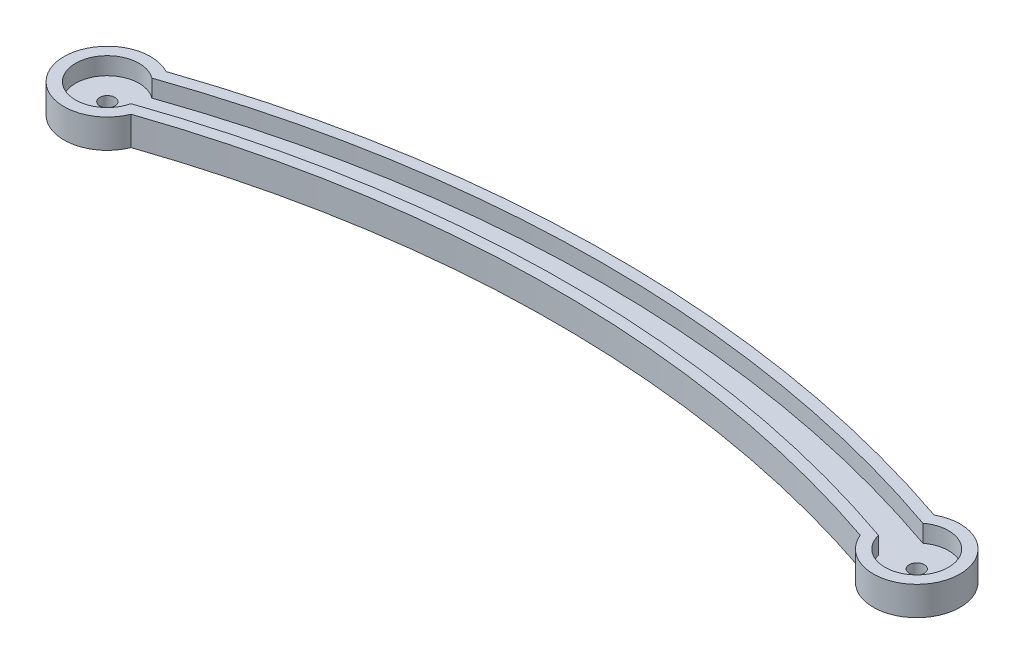
ISO-10303-21;
HEADER;
FILE_DESCRIPTION(('STEP AP214'),'2;1');
FILE_NAME('part.step','',(''),(''),'','','');
FILE_SCHEMA(('AUTOMOTIVE_DESIGN { 1 0 10303 214 1 1 1 1 }'));
ENDSEC;
DATA;
#1=APPLICATION_CONTEXT('core data for automotive mechanical design processes');
#2=APPLICATION_PROTOCOL_DEFINITION('international standard','automotive_design',2000,#1);
#3=PRODUCT_CONTEXT('',#1,'mechanical');
#4=PRODUCT('Part','Part','',(#3));
#5=PRODUCT_RELATED_PRODUCT_CATEGORY('part','',(#4));
#6=PRODUCT_DEFINITION_FORMATION('','',#4);
#7=PRODUCT_DEFINITION_CONTEXT('part definition',#1,'design');
#8=PRODUCT_DEFINITION('design','',#6,#7);
#9=PRODUCT_DEFINITION_SHAPE('','',#8);
#10=(LENGTH_UNIT() NAMED_UNIT(*) SI_UNIT(.MILLI.,.METRE.));
#11=(NAMED_UNIT(*) PLANE_ANGLE_UNIT() SI_UNIT($,.RADIAN.));
#12=(NAMED_UNIT(*) SI_UNIT($,.STERADIAN.) SOLID_ANGLE_UNIT());
#13=UNCERTAINTY_MEASURE_WITH_UNIT(LENGTH_MEASURE(1.E-05),#10,'distance_accuracy_value','');
#14=(GEOMETRIC_REPRESENTATION_CONTEXT(3) GLOBAL_UNCERTAINTY_ASSIGNED_CONTEXT((#13)) GLOBAL_UNIT_ASSIGNED_CONTEXT((#10,
#11,#12)) REPRESENTATION_CONTEXT('',''));
#15=CARTESIAN_POINT('',(0.,0.,0.));
#16=DIRECTION('',(0.,0.,1.));
#17=DIRECTION('',(1.,0.,0.));
#18=AXIS2_PLACEMENT_3D('',#15,#16,#17);
#19=CARTESIAN_POINT('',(105.,2.,93.674969975976));
#20=DIRECTION('',(0.,-1.,0.));
#21=DIRECTION('',(0.,0.,-1.));
#22=AXIS2_PLACEMENT_3D('',#19,#20,#21);
#23=PLANE('',#22);
#24=CARTESIAN_POINT('',(140.,2.,0.));
#25=DIRECTION('',(0.,1.,0.));
#26=DIRECTION('',(0.,0.,1.));
#27=AXIS2_PLACEMENT_3D('',#24,#25,#26);
#28=CIRCLE('',#27,1.3);
#29=CARTESIAN_POINT('',(140.,2.,1.3));
#30=VERTEX_POINT('',#29);
#31=EDGE_CURVE('E247',#30,#30,#28,.T.);
#32=ORIENTED_EDGE('',*,*,#31,.F.);
#33=EDGE_LOOP('',(#32));
#34=FACE_BOUND('',#33,.T.);
#35=CARTESIAN_POINT('',(70.,2.,187.349939951952));
#36=DIRECTION('',(0.,-1.,0.));
#37=DIRECTION('',(0.,0.,-1.));
#38=AXIS2_PLACEMENT_3D('',#35,#36,#37);
#39=CIRCLE('',#38,197.);
#40=CARTESIAN_POINT('',(5.35399867099803,2.,1.25884797769686));
#41=VERTEX_POINT('',#40);
#42=CARTESIAN_POINT('',(134.646001329002,2.,1.25884797769687));
#43=VERTEX_POINT('',#42);
#44=EDGE_CURVE('E119',#41,#43,#39,.T.);
#45=ORIENTED_EDGE('',*,*,#44,.T.);
#46=CARTESIAN_POINT('',(140.,2.,0.));
#47=DIRECTION('',(0.,-1.,0.));
#48=DIRECTION('',(0.,0.,-1.));
#49=AXIS2_PLACEMENT_3D('',#46,#47,#48);
#50=CIRCLE('',#49,5.50000000000002);
#51=CARTESIAN_POINT('',(136.681222163445,2.,-4.38585381329485));
#52=VERTEX_POINT('',#51);
#53=EDGE_CURVE('E113',#43,#52,#50,.F.);
#54=ORIENTED_EDGE('',*,*,#53,.T.);
#55=CARTESIAN_POINT('',(70.,2.,187.349939951952));
#56=DIRECTION('',(0.,-1.,0.));
#57=DIRECTION('',(0.,0.,-1.));
#58=AXIS2_PLACEMENT_3D('',#55,#56,#57);
#59=CIRCLE('',#58,203.);
#60=CARTESIAN_POINT('',(3.31877783655477,2.,-4.38585381329485));
#61=VERTEX_POINT('',#60);
#62=EDGE_CURVE('E117',#52,#61,#59,.F.);
#63=ORIENTED_EDGE('',*,*,#62,.T.);
#64=CARTESIAN_POINT('',(0.,2.,0.));
#65=DIRECTION('',(0.,-1.,0.));
#66=DIRECTION('',(0.,0.,-1.));
#67=AXIS2_PLACEMENT_3D('',#64,#65,#66);
#68=CIRCLE('',#67,5.50000000000001);
#69=EDGE_CURVE('E134',#61,#41,#68,.F.);
#70=ORIENTED_EDGE('',*,*,#69,.T.);
#71=EDGE_LOOP('',(#45,#54,#63,#70));
#72=FACE_BOUND('',#71,.T.);
#73=CARTESIAN_POINT('',(0.,2.,0.));
#74=DIRECTION('',(0.,1.,0.));
#75=DIRECTION('',(0.,0.,1.));
#76=AXIS2_PLACEMENT_3D('',#73,#74,#75);
#77=CIRCLE('',#76,1.29999999999999);
#78=CARTESIAN_POINT('',(0.,2.,1.29999999999999));
#79=VERTEX_POINT('',#78);
#80=EDGE_CURVE('E215',#79,#79,#77,.T.);
#81=ORIENTED_EDGE('',*,*,#80,.F.);
#82=EDGE_LOOP('',(#81));
#83=FACE_BOUND('',#82,.T.);
#84=ADVANCED_FACE('F39',(#34,#72,#83),#23,.F.);
#85=CARTESIAN_POINT('',(70.,5.,187.349939951952));
#86=DIRECTION('',(0.,-1.,0.));
#87=DIRECTION('',(0.,0.,-1.));
#88=AXIS2_PLACEMENT_3D('',#85,#86,#87);
#89=CYLINDRICAL_SURFACE('',#88,195.);
#90=CARTESIAN_POINT('',(70.,0.,187.349939951952));
#91=DIRECTION('',(0.,-1.,0.));
#92=DIRECTION('',(0.,0.,-1.));
#93=AXIS2_PLACEMENT_3D('',#90,#91,#92);
#94=CIRCLE('',#93,195.);
#95=CARTESIAN_POINT('',(6.947544161013,0.,2.825177893651));
#96=VERTEX_POINT('',#95);
#97=CARTESIAN_POINT('',(133.052455838987,0.,2.825177893651));
#98=VERTEX_POINT('',#97);
#99=EDGE_CURVE('E154',#96,#98,#94,.T.);
#100=ORIENTED_EDGE('',*,*,#99,.T.);
#101=DIRECTION('',(0.,-1.,0.));
#102=VECTOR('',#101,1.);
#103=CARTESIAN_POINT('',(133.052455838987,5.,2.825177893651));
#104=LINE('',#103,#102);
#105=CARTESIAN_POINT('',(133.052455838987,5.,2.825177893651));
#106=VERTEX_POINT('',#105);
#107=EDGE_CURVE('E11',#106,#98,#104,.T.);
#108=ORIENTED_EDGE('',*,*,#107,.F.);
#109=CARTESIAN_POINT('',(70.,5.,187.349939951952));
#110=DIRECTION('',(0.,-1.,0.));
#111=DIRECTION('',(0.,0.,-1.));
#112=AXIS2_PLACEMENT_3D('',#109,#110,#111);
#113=CIRCLE('',#112,195.);
#114=CARTESIAN_POINT('',(6.947544161013,5.,2.825177893651));
#115=VERTEX_POINT('',#114);
#116=EDGE_CURVE('E147',#115,#106,#113,.T.);
#117=ORIENTED_EDGE('',*,*,#116,.F.);
#118=DIRECTION('',(0.,-1.,0.));
#119=VECTOR('',#118,1.);
#120=CARTESIAN_POINT('',(6.947544161013,5.,2.825177893651));
#121=LINE('',#120,#119);
#122=EDGE_CURVE('E153',#115,#96,#121,.T.);
#123=ORIENTED_EDGE('',*,*,#122,.T.);
#124=EDGE_LOOP('',(#100,#108,#117,#123));
#125=FACE_BOUND('',#124,.T.);
#126=ADVANCED_FACE('F41',(#125),#89,.F.);
#127=CARTESIAN_POINT('',(140.,5.,0.));
#128=DIRECTION('',(0.,-1.,0.));
#129=DIRECTION('',(0.,0.,-1.));
#130=AXIS2_PLACEMENT_3D('',#127,#128,#129);
#131=CYLINDRICAL_SURFACE('',#130,7.50000000000002);
#132=CARTESIAN_POINT('',(140.,0.,0.));
#133=DIRECTION('',(0.,1.,0.));
#134=DIRECTION('',(0.,0.,1.));
#135=AXIS2_PLACEMENT_3D('',#132,#133,#134);
#136=CIRCLE('',#135,7.50000000000002);
#137=CARTESIAN_POINT('',(136.421518066549,0.,-6.59124169272887));
#138=VERTEX_POINT('',#137);
#139=EDGE_CURVE('E157',#98,#138,#136,.T.);
#140=ORIENTED_EDGE('',*,*,#139,.T.);
#141=DIRECTION('',(0.,-1.,0.));
#142=VECTOR('',#141,1.);
#143=CARTESIAN_POINT('',(136.421518066549,5.,-6.59124169272887));
#144=LINE('',#143,#142);
#145=CARTESIAN_POINT('',(136.421518066549,5.,-6.59124169272887));
#146=VERTEX_POINT('',#145);
#147=EDGE_CURVE('E47',#146,#138,#144,.T.);
#148=ORIENTED_EDGE('',*,*,#147,.F.);
#149=CARTESIAN_POINT('',(140.,5.,0.));
#150=DIRECTION('',(0.,1.,0.));
#151=DIRECTION('',(0.,0.,1.));
#152=AXIS2_PLACEMENT_3D('',#149,#150,#151);
#153=CIRCLE('',#152,7.50000000000002);
#154=EDGE_CURVE('E91',#106,#146,#153,.T.);
#155=ORIENTED_EDGE('',*,*,#154,.F.);
#156=ORIENTED_EDGE('',*,*,#107,.T.);
#157=EDGE_LOOP('',(#140,#148,#155,#156));
#158=FACE_BOUND('',#157,.T.);
#159=ADVANCED_FACE('F186',(#158),#131,.T.);
#160=CARTESIAN_POINT('',(70.,5.,187.349939951952));
#161=DIRECTION('',(0.,-1.,0.));
#162=DIRECTION('',(0.,0.,-1.));
#163=AXIS2_PLACEMENT_3D('',#160,#161,#162);
#164=CYLINDRICAL_SURFACE('',#163,205.);
#165=CARTESIAN_POINT('',(70.,0.,187.349939951952));
#166=DIRECTION('',(0.,1.,0.));
#167=DIRECTION('',(0.,0.,-1.));
#168=AXIS2_PLACEMENT_3D('',#165,#166,#167);
#169=CIRCLE('',#168,205.);
#170=CARTESIAN_POINT('',(3.57848193345074,0.,-6.59124169272883));
#171=VERTEX_POINT('',#170);
#172=EDGE_CURVE('E159',#138,#171,#169,.T.);
#173=ORIENTED_EDGE('',*,*,#172,.T.);
#174=DIRECTION('',(0.,-1.,0.));
#175=VECTOR('',#174,1.);
#176=CARTESIAN_POINT('',(3.57848193345074,5.,-6.59124169272883));
#177=LINE('',#176,#175);
#178=CARTESIAN_POINT('',(3.57848193345074,5.,-6.59124169272883));
#179=VERTEX_POINT('',#178);
#180=EDGE_CURVE('E163',#179,#171,#177,.T.);
#181=ORIENTED_EDGE('',*,*,#180,.F.);
#182=CARTESIAN_POINT('',(70.,5.,187.349939951952));
#183=DIRECTION('',(0.,1.,0.));
#184=DIRECTION('',(0.,0.,-1.));
#185=AXIS2_PLACEMENT_3D('',#182,#183,#184);
#186=CIRCLE('',#185,205.);
#187=EDGE_CURVE('E150',#146,#179,#186,.T.);
#188=ORIENTED_EDGE('',*,*,#187,.F.);
#189=ORIENTED_EDGE('',*,*,#147,.T.);
#190=EDGE_LOOP('',(#173,#181,#188,#189));
#191=FACE_BOUND('',#190,.T.);
#192=ADVANCED_FACE('F168',(#191),#164,.T.);
#193=CARTESIAN_POINT('',(0.,5.,0.));
#194=DIRECTION('',(0.,-1.,0.));
#195=DIRECTION('',(0.,0.,-1.));
#196=AXIS2_PLACEMENT_3D('',#193,#194,#195);
#197=CYLINDRICAL_SURFACE('',#196,7.50000000000001);
#198=CARTESIAN_POINT('',(0.,0.,0.));
#199=DIRECTION('',(0.,1.,0.));
#200=DIRECTION('',(0.,0.,1.));
#201=AXIS2_PLACEMENT_3D('',#198,#199,#200);
#202=CIRCLE('',#201,7.50000000000001);
#203=EDGE_CURVE('E84',#171,#96,#202,.T.);
#204=ORIENTED_EDGE('',*,*,#203,.T.);
#205=ORIENTED_EDGE('',*,*,#122,.F.);
#206=CARTESIAN_POINT('',(0.,5.,0.));
#207=DIRECTION('',(0.,1.,0.));
#208=DIRECTION('',(0.,0.,1.));
#209=AXIS2_PLACEMENT_3D('',#206,#207,#208);
#210=CIRCLE('',#209,7.50000000000001);
#211=EDGE_CURVE('E63',#179,#115,#210,.T.);
#212=ORIENTED_EDGE('',*,*,#211,.F.);
#213=ORIENTED_EDGE('',*,*,#180,.T.);
#214=EDGE_LOOP('',(#204,#205,#212,#213));
#215=FACE_BOUND('',#214,.T.);
#216=ADVANCED_FACE('F176',(#215),#197,.T.);
#217=CARTESIAN_POINT('',(105.,5.,93.674969975976));
#218=DIRECTION('',(0.,-1.,0.));
#219=DIRECTION('',(0.,0.,-1.));
#220=AXIS2_PLACEMENT_3D('',#217,#218,#219);
#221=PLANE('',#220);
#222=CARTESIAN_POINT('',(70.,5.,187.349939951952));
#223=DIRECTION('',(0.,-1.,0.));
#224=DIRECTION('',(0.,0.,-1.));
#225=AXIS2_PLACEMENT_3D('',#222,#223,#224);
#226=CIRCLE('',#225,197.);
#227=CARTESIAN_POINT('',(5.35399867099803,5.,1.25884797769686));
#228=VERTEX_POINT('',#227);
#229=CARTESIAN_POINT('',(134.646001329002,5.,1.25884797769687));
#230=VERTEX_POINT('',#229);
#231=EDGE_CURVE('E136',#228,#230,#226,.T.);
#232=ORIENTED_EDGE('',*,*,#231,.F.);
#233=CARTESIAN_POINT('',(0.,5.,0.));
#234=DIRECTION('',(0.,-1.,0.));
#235=DIRECTION('',(0.,0.,-1.));
#236=AXIS2_PLACEMENT_3D('',#233,#234,#235);
#237=CIRCLE('',#236,5.50000000000001);
#238=CARTESIAN_POINT('',(3.31877783655477,5.,-4.38585381329485));
#239=VERTEX_POINT('',#238);
#240=EDGE_CURVE('E145',#239,#228,#237,.F.);
#241=ORIENTED_EDGE('',*,*,#240,.F.);
#242=CARTESIAN_POINT('',(70.,5.,187.349939951952));
#243=DIRECTION('',(0.,-1.,0.));
#244=DIRECTION('',(0.,0.,-1.));
#245=AXIS2_PLACEMENT_3D('',#242,#243,#244);
#246=CIRCLE('',#245,203.);
#247=CARTESIAN_POINT('',(136.681222163445,5.,-4.38585381329485));
#248=VERTEX_POINT('',#247);
#249=EDGE_CURVE('E143',#248,#239,#246,.F.);
#250=ORIENTED_EDGE('',*,*,#249,.F.);
#251=CARTESIAN_POINT('',(140.,5.,0.));
#252=DIRECTION('',(0.,-1.,0.));
#253=DIRECTION('',(0.,0.,-1.));
#254=AXIS2_PLACEMENT_3D('',#251,#252,#253);
#255=CIRCLE('',#254,5.50000000000002);
#256=EDGE_CURVE('E128',#230,#248,#255,.F.);
#257=ORIENTED_EDGE('',*,*,#256,.F.);
#258=EDGE_LOOP('',(#232,#241,#250,#257));
#259=FACE_BOUND('',#258,.T.);
#260=ORIENTED_EDGE('',*,*,#116,.T.);
#261=ORIENTED_EDGE('',*,*,#154,.T.);
#262=ORIENTED_EDGE('',*,*,#187,.T.);
#263=ORIENTED_EDGE('',*,*,#211,.T.);
#264=EDGE_LOOP('',(#260,#261,#262,#263));
#265=FACE_BOUND('',#264,.T.);
#266=ADVANCED_FACE('F178',(#259,#265),#221,.F.);
#267=CARTESIAN_POINT('',(105.,0.,93.674969975976));
#268=DIRECTION('',(0.,-1.,0.));
#269=DIRECTION('',(0.,0.,-1.));
#270=AXIS2_PLACEMENT_3D('',#267,#268,#269);
#271=PLANE('',#270);
#272=CARTESIAN_POINT('',(140.,0.,0.));
#273=DIRECTION('',(0.,-1.,0.));
#274=DIRECTION('',(0.,0.,-1.));
#275=AXIS2_PLACEMENT_3D('',#272,#273,#274);
#276=CIRCLE('',#275,1.3);
#277=CARTESIAN_POINT('',(140.,0.,-1.3));
#278=VERTEX_POINT('',#277);
#279=EDGE_CURVE('E210',#278,#278,#276,.T.);
#280=ORIENTED_EDGE('',*,*,#279,.F.);
#281=EDGE_LOOP('',(#280));
#282=FACE_BOUND('',#281,.T.);
#283=CARTESIAN_POINT('',(0.,0.,0.));
#284=DIRECTION('',(0.,-1.,0.));
#285=DIRECTION('',(0.,0.,-1.));
#286=AXIS2_PLACEMENT_3D('',#283,#284,#285);
#287=CIRCLE('',#286,1.29999999999999);
#288=CARTESIAN_POINT('',(0.,0.,-1.29999999999999));
#289=VERTEX_POINT('',#288);
#290=EDGE_CURVE('E213',#289,#289,#287,.T.);
#291=ORIENTED_EDGE('',*,*,#290,.F.);
#292=EDGE_LOOP('',(#291));
#293=FACE_BOUND('',#292,.T.);
#294=ORIENTED_EDGE('',*,*,#99,.F.);
#295=ORIENTED_EDGE('',*,*,#203,.F.);
#296=ORIENTED_EDGE('',*,*,#172,.F.);
#297=ORIENTED_EDGE('',*,*,#139,.F.);
#298=EDGE_LOOP('',(#294,#295,#296,#297));
#299=FACE_BOUND('',#298,.T.);
#300=ADVANCED_FACE('F172',(#282,#293,#299),#271,.T.);
#301=CARTESIAN_POINT('',(70.,5.,187.349939951952));
#302=DIRECTION('',(0.,-1.,0.));
#303=DIRECTION('',(0.,0.,-1.));
#304=AXIS2_PLACEMENT_3D('',#301,#302,#303);
#305=CYLINDRICAL_SURFACE('',#304,197.);
#306=ORIENTED_EDGE('',*,*,#44,.F.);
#307=DIRECTION('',(0.,-1.,0.));
#308=VECTOR('',#307,1.);
#309=CARTESIAN_POINT('',(5.35399867099803,5.,1.25884797769686));
#310=LINE('',#309,#308);
#311=EDGE_CURVE('E139',#228,#41,#310,.T.);
#312=ORIENTED_EDGE('',*,*,#311,.F.);
#313=ORIENTED_EDGE('',*,*,#231,.T.);
#314=DIRECTION('',(0.,-1.,0.));
#315=VECTOR('',#314,1.);
#316=CARTESIAN_POINT('',(134.646001329002,5.,1.25884797769687));
#317=LINE('',#316,#315);
#318=EDGE_CURVE('E131',#230,#43,#317,.T.);
#319=ORIENTED_EDGE('',*,*,#318,.T.);
#320=EDGE_LOOP('',(#306,#312,#313,#319));
#321=FACE_BOUND('',#320,.T.);
#322=ADVANCED_FACE('F200',(#321),#305,.T.);
#323=CARTESIAN_POINT('',(140.,5.,0.));
#324=DIRECTION('',(0.,-1.,0.));
#325=DIRECTION('',(0.,0.,-1.));
#326=AXIS2_PLACEMENT_3D('',#323,#324,#325);
#327=CYLINDRICAL_SURFACE('',#326,5.50000000000002);
#328=ORIENTED_EDGE('',*,*,#53,.F.);
#329=ORIENTED_EDGE('',*,*,#318,.F.);
#330=ORIENTED_EDGE('',*,*,#256,.T.);
#331=DIRECTION('',(0.,-1.,0.));
#332=VECTOR('',#331,1.);
#333=CARTESIAN_POINT('',(136.681222163445,5.,-4.38585381329485));
#334=LINE('',#333,#332);
#335=EDGE_CURVE('E125',#248,#52,#334,.T.);
#336=ORIENTED_EDGE('',*,*,#335,.T.);
#337=EDGE_LOOP('',(#328,#329,#330,#336));
#338=FACE_BOUND('',#337,.T.);
#339=ADVANCED_FACE('F126',(#338),#327,.F.);
#340=CARTESIAN_POINT('',(70.,5.,187.349939951952));
#341=DIRECTION('',(0.,-1.,0.));
#342=DIRECTION('',(0.,0.,-1.));
#343=AXIS2_PLACEMENT_3D('',#340,#341,#342);
#344=CYLINDRICAL_SURFACE('',#343,203.);
#345=ORIENTED_EDGE('',*,*,#62,.F.);
#346=ORIENTED_EDGE('',*,*,#335,.F.);
#347=ORIENTED_EDGE('',*,*,#249,.T.);
#348=DIRECTION('',(0.,-1.,0.));
#349=VECTOR('',#348,1.);
#350=CARTESIAN_POINT('',(3.31877783655477,5.,-4.38585381329485));
#351=LINE('',#350,#349);
#352=EDGE_CURVE('E54',#239,#61,#351,.T.);
#353=ORIENTED_EDGE('',*,*,#352,.T.);
#354=EDGE_LOOP('',(#345,#346,#347,#353));
#355=FACE_BOUND('',#354,.T.);
#356=ADVANCED_FACE('F133',(#355),#344,.F.);
#357=CARTESIAN_POINT('',(0.,5.,0.));
#358=DIRECTION('',(0.,-1.,0.));
#359=DIRECTION('',(0.,0.,-1.));
#360=AXIS2_PLACEMENT_3D('',#357,#358,#359);
#361=CYLINDRICAL_SURFACE('',#360,5.50000000000001);
#362=ORIENTED_EDGE('',*,*,#69,.F.);
#363=ORIENTED_EDGE('',*,*,#352,.F.);
#364=ORIENTED_EDGE('',*,*,#240,.T.);
#365=ORIENTED_EDGE('',*,*,#311,.T.);
#366=EDGE_LOOP('',(#362,#363,#364,#365));
#367=FACE_BOUND('',#366,.T.);
#368=ADVANCED_FACE('F197',(#367),#361,.F.);
#369=CARTESIAN_POINT('',(0.,2.,0.));
#370=DIRECTION('',(0.,1.,0.));
#371=DIRECTION('',(0.,0.,1.));
#372=AXIS2_PLACEMENT_3D('',#369,#370,#371);
#373=CYLINDRICAL_SURFACE('',#372,1.29999999999999);
#374=ORIENTED_EDGE('',*,*,#80,.T.);
#375=EDGE_LOOP('',(#374));
#376=FACE_BOUND('',#375,.T.);
#377=ORIENTED_EDGE('',*,*,#290,.T.);
#378=EDGE_LOOP('',(#377));
#379=FACE_BOUND('',#378,.T.);
#380=ADVANCED_FACE('F228',(#376,#379),#373,.F.);
#381=CARTESIAN_POINT('',(140.,2.,0.));
#382=DIRECTION('',(0.,1.,0.));
#383=DIRECTION('',(0.,0.,1.));
#384=AXIS2_PLACEMENT_3D('',#381,#382,#383);
#385=CYLINDRICAL_SURFACE('',#384,1.3);
#386=ORIENTED_EDGE('',*,*,#31,.T.);
#387=EDGE_LOOP('',(#386));
#388=FACE_BOUND('',#387,.T.);
#389=ORIENTED_EDGE('',*,*,#279,.T.);
#390=EDGE_LOOP('',(#389));
#391=FACE_BOUND('',#390,.T.);
#392=ADVANCED_FACE('F233',(#388,#391),#385,.F.);
#393=CLOSED_SHELL('',(#84,#126,#159,#192,#216,#266,#300,#322,#339,#356,#368,#380,#392));
#394=MANIFOLD_SOLID_BREP('B2',#393);
#395=ADVANCED_BREP_SHAPE_REPRESENTATION('',(#18,#394),#14);
#396=SHAPE_DEFINITION_REPRESENTATION(#9,#395);
ENDSEC;
END-ISO-10303-21;
